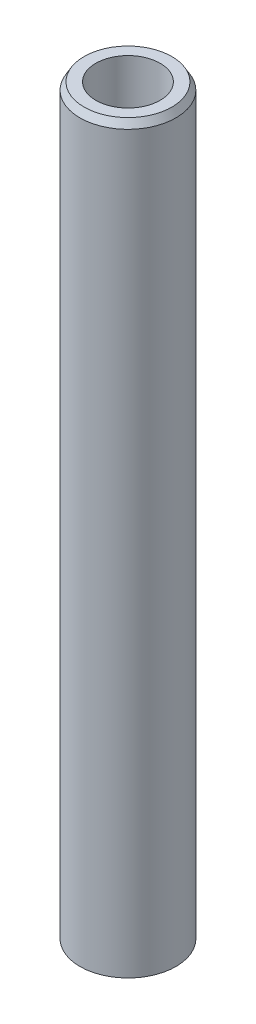
ISO-10303-21;
HEADER;
FILE_DESCRIPTION(('STEP AP214'),'2;1');
FILE_NAME('part.step','',(''),(''),'','','');
FILE_SCHEMA(('AUTOMOTIVE_DESIGN { 1 0 10303 214 1 1 1 1 }'));
ENDSEC;
DATA;
#1=APPLICATION_CONTEXT('core data for automotive mechanical design processes');
#2=APPLICATION_PROTOCOL_DEFINITION('international standard','automotive_design',2000,#1);
#3=PRODUCT_CONTEXT('',#1,'mechanical');
#4=PRODUCT('Part','Part','',(#3));
#5=PRODUCT_RELATED_PRODUCT_CATEGORY('part','',(#4));
#6=PRODUCT_DEFINITION_FORMATION('','',#4);
#7=PRODUCT_DEFINITION_CONTEXT('part definition',#1,'design');
#8=PRODUCT_DEFINITION('design','',#6,#7);
#9=PRODUCT_DEFINITION_SHAPE('','',#8);
#10=(LENGTH_UNIT() NAMED_UNIT(*) SI_UNIT(.MILLI.,.METRE.));
#11=(NAMED_UNIT(*) PLANE_ANGLE_UNIT() SI_UNIT($,.RADIAN.));
#12=(NAMED_UNIT(*) SI_UNIT($,.STERADIAN.) SOLID_ANGLE_UNIT());
#13=UNCERTAINTY_MEASURE_WITH_UNIT(LENGTH_MEASURE(1.E-05),#10,'distance_accuracy_value','');
#14=(GEOMETRIC_REPRESENTATION_CONTEXT(3) GLOBAL_UNCERTAINTY_ASSIGNED_CONTEXT((#13)) GLOBAL_UNIT_ASSIGNED_CONTEXT((#10,
#11,#12)) REPRESENTATION_CONTEXT('',''));
#15=CARTESIAN_POINT('',(0.,0.,0.));
#16=DIRECTION('',(0.,0.,1.));
#17=DIRECTION('',(1.,0.,0.));
#18=AXIS2_PLACEMENT_3D('',#15,#16,#17);
#19=CARTESIAN_POINT('',(0.,155.424492889429,0.));
#20=DIRECTION('',(0.,-1.,0.));
#21=DIRECTION('',(0.,0.,-1.));
#22=AXIS2_PLACEMENT_3D('',#19,#20,#21);
#23=CYLINDRICAL_SURFACE('',#22,10.);
#24=CARTESIAN_POINT('',(0.,153.920538232445,0.));
#25=DIRECTION('',(0.,1.,0.));
#26=DIRECTION('',(0.,0.,1.));
#27=AXIS2_PLACEMENT_3D('',#24,#25,#26);
#28=CIRCLE('',#27,10.);
#29=CARTESIAN_POINT('',(0.,153.920538232445,10.));
#30=VERTEX_POINT('',#29);
#31=EDGE_CURVE('E50',#30,#30,#28,.F.);
#32=ORIENTED_EDGE('',*,*,#31,.T.);
#33=EDGE_LOOP('',(#32));
#34=FACE_BOUND('',#33,.T.);
#35=CARTESIAN_POINT('',(0.,0.868308626058967,0.));
#36=DIRECTION('',(0.,1.,0.));
#37=DIRECTION('',(0.,0.,1.));
#38=AXIS2_PLACEMENT_3D('',#35,#36,#37);
#39=CIRCLE('',#38,10.);
#40=CARTESIAN_POINT('',(0.,0.868308626058967,10.));
#41=VERTEX_POINT('',#40);
#42=EDGE_CURVE('E51',#41,#41,#39,.T.);
#43=ORIENTED_EDGE('',*,*,#42,.T.);
#44=EDGE_LOOP('',(#43));
#45=FACE_BOUND('',#44,.T.);
#46=ADVANCED_FACE('F39',(#34,#45),#23,.T.);
#47=CARTESIAN_POINT('',(0.,155.424492889429,0.));
#48=DIRECTION('',(0.,1.,0.));
#49=DIRECTION('',(0.,0.,1.));
#50=AXIS2_PLACEMENT_3D('',#47,#48,#49);
#51=PLANE('',#50);
#52=CARTESIAN_POINT('',(0.,155.424492889429,0.));
#53=DIRECTION('',(0.,1.,0.));
#54=DIRECTION('',(0.,0.,1.));
#55=AXIS2_PLACEMENT_3D('',#52,#53,#54);
#56=CIRCLE('',#55,9.13169137394102);
#57=CARTESIAN_POINT('',(0.,155.424492889429,9.13169137394102));
#58=VERTEX_POINT('',#57);
#59=EDGE_CURVE('E54',#58,#58,#56,.T.);
#60=ORIENTED_EDGE('',*,*,#59,.T.);
#61=EDGE_LOOP('',(#60));
#62=FACE_BOUND('',#61,.T.);
#63=CARTESIAN_POINT('',(0.,155.424492889429,0.));
#64=DIRECTION('',(0.,1.,0.));
#65=DIRECTION('',(0.,0.,1.));
#66=AXIS2_PLACEMENT_3D('',#63,#64,#65);
#67=CIRCLE('',#66,6.69638003952383);
#68=CARTESIAN_POINT('',(0.,155.424492889429,6.69638003952383));
#69=VERTEX_POINT('',#68);
#70=EDGE_CURVE('E58',#69,#69,#67,.T.);
#71=ORIENTED_EDGE('',*,*,#70,.F.);
#72=EDGE_LOOP('',(#71));
#73=FACE_BOUND('',#72,.T.);
#74=ADVANCED_FACE('F69',(#62,#73),#51,.T.);
#75=CARTESIAN_POINT('',(0.,0.,0.));
#76=DIRECTION('',(0.,1.,0.));
#77=DIRECTION('',(0.,0.,1.));
#78=AXIS2_PLACEMENT_3D('',#75,#76,#77);
#79=PLANE('',#78);
#80=CARTESIAN_POINT('',(0.,0.,0.));
#81=DIRECTION('',(0.,1.,0.));
#82=DIRECTION('',(0.,0.,1.));
#83=AXIS2_PLACEMENT_3D('',#80,#81,#82);
#84=CIRCLE('',#83,8.49604534301554);
#85=CARTESIAN_POINT('',(0.,0.,8.49604534301554));
#86=VERTEX_POINT('',#85);
#87=EDGE_CURVE('E10',#86,#86,#84,.F.);
#88=ORIENTED_EDGE('',*,*,#87,.T.);
#89=EDGE_LOOP('',(#88));
#90=FACE_BOUND('',#89,.T.);
#91=CARTESIAN_POINT('',(0.,0.,0.));
#92=DIRECTION('',(0.,1.,0.));
#93=DIRECTION('',(0.,0.,1.));
#94=AXIS2_PLACEMENT_3D('',#91,#92,#93);
#95=CIRCLE('',#94,6.69638003952383);
#96=CARTESIAN_POINT('',(0.,0.,6.69638003952383));
#97=VERTEX_POINT('',#96);
#98=EDGE_CURVE('E63',#97,#97,#95,.T.);
#99=ORIENTED_EDGE('',*,*,#98,.T.);
#100=EDGE_LOOP('',(#99));
#101=FACE_BOUND('',#100,.T.);
#102=ADVANCED_FACE('F75',(#90,#101),#79,.F.);
#103=CARTESIAN_POINT('',(0.,155.424492889429,0.));
#104=DIRECTION('',(0.,-1.,0.));
#105=DIRECTION('',(0.,0.,-1.));
#106=AXIS2_PLACEMENT_3D('',#103,#104,#105);
#107=CYLINDRICAL_SURFACE('',#106,6.69638003952383);
#108=ORIENTED_EDGE('',*,*,#70,.T.);
#109=EDGE_LOOP('',(#108));
#110=FACE_BOUND('',#109,.T.);
#111=ORIENTED_EDGE('',*,*,#98,.F.);
#112=EDGE_LOOP('',(#111));
#113=FACE_BOUND('',#112,.T.);
#114=ADVANCED_FACE('F70',(#110,#113),#107,.F.);
#115=CARTESIAN_POINT('',(0.,155.424492889429,0.));
#116=DIRECTION('',(0.,-1.,0.));
#117=DIRECTION('',(0.,0.,-1.));
#118=AXIS2_PLACEMENT_3D('',#115,#116,#117);
#119=CONICAL_SURFACE('',#118,9.13169137394102,0.523598775598297);
#120=ORIENTED_EDGE('',*,*,#31,.F.);
#121=EDGE_LOOP('',(#120));
#122=FACE_BOUND('',#121,.T.);
#123=ORIENTED_EDGE('',*,*,#59,.F.);
#124=EDGE_LOOP('',(#123));
#125=FACE_BOUND('',#124,.T.);
#126=ADVANCED_FACE('F81',(#122,#125),#119,.T.);
#127=CARTESIAN_POINT('',(0.,0.868308626058967,0.));
#128=DIRECTION('',(0.,1.,0.));
#129=DIRECTION('',(0.,0.,1.));
#130=AXIS2_PLACEMENT_3D('',#127,#128,#129);
#131=CONICAL_SURFACE('',#130,10.,1.0471975511966);
#132=ORIENTED_EDGE('',*,*,#87,.F.);
#133=EDGE_LOOP('',(#132));
#134=FACE_BOUND('',#133,.T.);
#135=ORIENTED_EDGE('',*,*,#42,.F.);
#136=EDGE_LOOP('',(#135));
#137=FACE_BOUND('',#136,.T.);
#138=ADVANCED_FACE('F45',(#134,#137),#131,.T.);
#139=CLOSED_SHELL('',(#46,#74,#102,#114,#126,#138));
#140=MANIFOLD_SOLID_BREP('B2',#139);
#141=ADVANCED_BREP_SHAPE_REPRESENTATION('',(#18,#140),#14);
#142=SHAPE_DEFINITION_REPRESENTATION(#9,#141);
ENDSEC;
END-ISO-10303-21;
